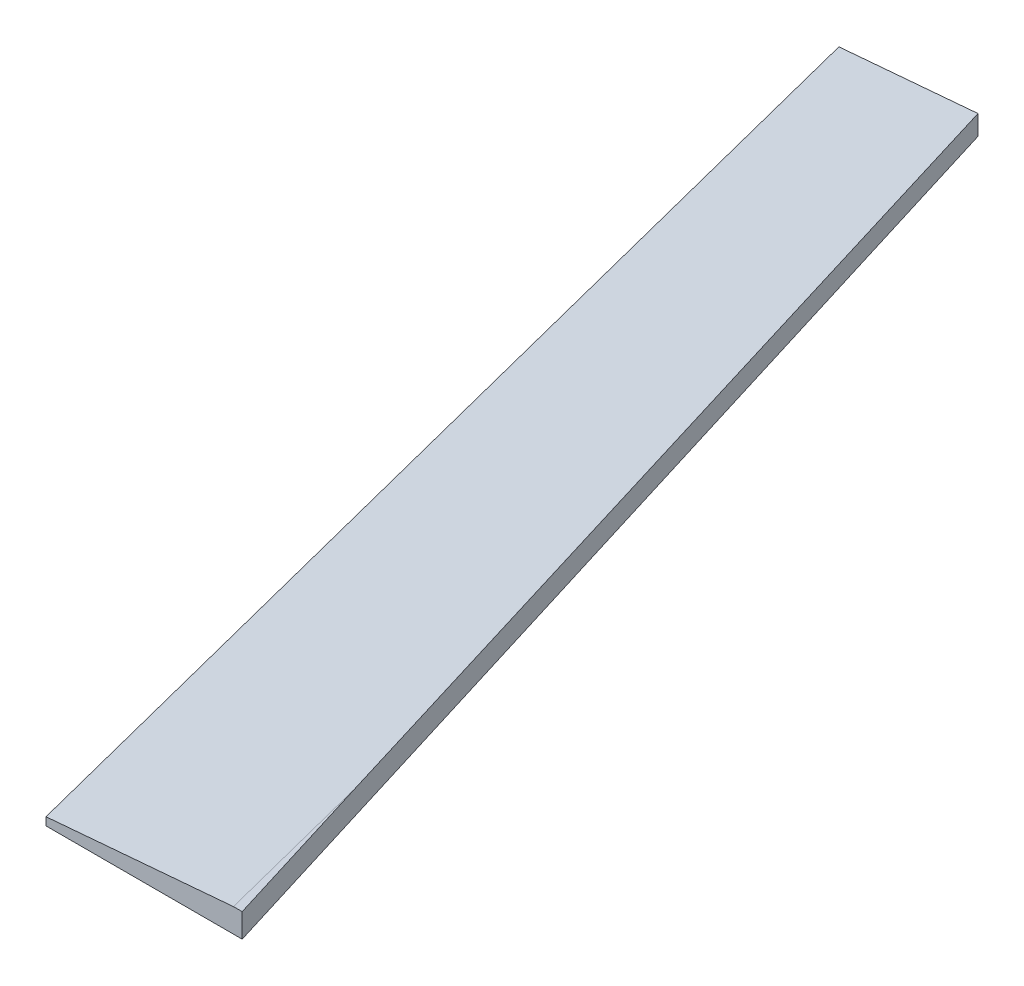
ISO-10303-21;
HEADER;
FILE_DESCRIPTION(('STEP AP214'),'2;1');
FILE_NAME('part.step','',(''),(''),'','','');
FILE_SCHEMA(('AUTOMOTIVE_DESIGN { 1 0 10303 214 1 1 1 1 }'));
ENDSEC;
DATA;
#1=APPLICATION_CONTEXT('core data for automotive mechanical design processes');
#2=APPLICATION_PROTOCOL_DEFINITION('international standard','automotive_design',2000,#1);
#3=PRODUCT_CONTEXT('',#1,'mechanical');
#4=PRODUCT('Part','Part','',(#3));
#5=PRODUCT_RELATED_PRODUCT_CATEGORY('part','',(#4));
#6=PRODUCT_DEFINITION_FORMATION('','',#4);
#7=PRODUCT_DEFINITION_CONTEXT('part definition',#1,'design');
#8=PRODUCT_DEFINITION('design','',#6,#7);
#9=PRODUCT_DEFINITION_SHAPE('','',#8);
#10=(LENGTH_UNIT() NAMED_UNIT(*) SI_UNIT(.MILLI.,.METRE.));
#11=(NAMED_UNIT(*) PLANE_ANGLE_UNIT() SI_UNIT($,.RADIAN.));
#12=(NAMED_UNIT(*) SI_UNIT($,.STERADIAN.) SOLID_ANGLE_UNIT());
#13=UNCERTAINTY_MEASURE_WITH_UNIT(LENGTH_MEASURE(1.E-05),#10,'distance_accuracy_value','');
#14=(GEOMETRIC_REPRESENTATION_CONTEXT(3) GLOBAL_UNCERTAINTY_ASSIGNED_CONTEXT((#13)) GLOBAL_UNIT_ASSIGNED_CONTEXT((#10,
#11,#12)) REPRESENTATION_CONTEXT('',''));
#15=CARTESIAN_POINT('',(0.,0.,0.));
#16=DIRECTION('',(0.,0.,1.));
#17=DIRECTION('',(1.,0.,0.));
#18=AXIS2_PLACEMENT_3D('',#15,#16,#17);
#19=CARTESIAN_POINT('',(126.581568969478,3.81,16.6787766494861));
#20=DIRECTION('',(0.,0.,1.));
#21=DIRECTION('',(1.,0.,0.));
#22=AXIS2_PLACEMENT_3D('',#19,#20,#21);
#23=PLANE('',#22);
#24=DIRECTION('',(0.,-1.,0.));
#25=VECTOR('',#24,1.);
#26=CARTESIAN_POINT('',(104.349973937028,3.81,16.6787766494861));
#27=LINE('',#26,#25);
#28=CARTESIAN_POINT('',(104.349973937028,1.2699999999998,16.6787766494861));
#29=VERTEX_POINT('',#28);
#30=CARTESIAN_POINT('',(104.349973937028,0.,16.6787766494861));
#31=VERTEX_POINT('',#30);
#32=EDGE_CURVE('E118',#29,#31,#27,.T.);
#33=ORIENTED_EDGE('',*,*,#32,.F.);
#34=DIRECTION('',(0.996424489399842,0.084488087469558,0.));
#35=VECTOR('',#34,1.);
#36=CARTESIAN_POINT('',(122.255576477698,2.78823859182976,16.6787766494861));
#37=LINE('',#36,#35);
#38=CARTESIAN_POINT('',(126.581568969478,3.15504494386778,16.6787766494861));
#39=VERTEX_POINT('',#38);
#40=EDGE_CURVE('E44',#29,#39,#37,.T.);
#41=ORIENTED_EDGE('',*,*,#40,.T.);
#42=DIRECTION('',(0.,-1.,0.));
#43=VECTOR('',#42,1.);
#44=CARTESIAN_POINT('',(126.581568969478,3.81,16.6787766494861));
#45=LINE('',#44,#43);
#46=CARTESIAN_POINT('',(126.581568969478,0.,16.6787766494861));
#47=VERTEX_POINT('',#46);
#48=EDGE_CURVE('E102',#39,#47,#45,.T.);
#49=ORIENTED_EDGE('',*,*,#48,.T.);
#50=DIRECTION('',(-1.,0.,0.));
#51=VECTOR('',#50,1.);
#52=CARTESIAN_POINT('',(126.581568969478,0.,16.6787766494861));
#53=LINE('',#52,#51);
#54=EDGE_CURVE('E109',#47,#31,#53,.T.);
#55=ORIENTED_EDGE('',*,*,#54,.T.);
#56=EDGE_LOOP('',(#33,#41,#49,#55));
#57=FACE_BOUND('',#56,.T.);
#58=ADVANCED_FACE('F35',(#57),#23,.F.);
#59=CARTESIAN_POINT('',(104.349973937028,3.81,16.6787766494861));
#60=DIRECTION('',(0.969168531093622,0.,-0.246398779091599));
#61=DIRECTION('',(-0.246398779091599,0.,-0.969168531093622));
#62=AXIS2_PLACEMENT_3D('',#59,#60,#61);
#63=PLANE('',#62);
#64=DIRECTION('',(0.,-1.,0.));
#65=VECTOR('',#64,1.);
#66=CARTESIAN_POINT('',(147.550785662563,3.81,186.601969436592));
#67=LINE('',#66,#65);
#68=CARTESIAN_POINT('',(147.550785662563,1.2699999999998,186.601969436592));
#69=VERTEX_POINT('',#68);
#70=CARTESIAN_POINT('',(147.550785662563,0.,186.601969436592));
#71=VERTEX_POINT('',#70);
#72=EDGE_CURVE('E101',#69,#71,#67,.T.);
#73=ORIENTED_EDGE('',*,*,#72,.F.);
#74=DIRECTION('',(-0.246398779091599,0.,-0.969168531093622));
#75=VECTOR('',#74,1.);
#76=CARTESIAN_POINT('',(104.349973937028,1.2699999999998,16.6787766494861));
#77=LINE('',#76,#75);
#78=EDGE_CURVE('E58',#69,#29,#77,.T.);
#79=ORIENTED_EDGE('',*,*,#78,.T.);
#80=ORIENTED_EDGE('',*,*,#32,.T.);
#81=DIRECTION('',(0.246398779091599,0.,0.969168531093622));
#82=VECTOR('',#81,1.);
#83=CARTESIAN_POINT('',(104.349973937028,0.,16.6787766494861));
#84=LINE('',#83,#82);
#85=EDGE_CURVE('E112',#31,#71,#84,.T.);
#86=ORIENTED_EDGE('',*,*,#85,.T.);
#87=EDGE_LOOP('',(#73,#79,#80,#86));
#88=FACE_BOUND('',#87,.T.);
#89=ADVANCED_FACE('F124',(#88),#63,.F.);
#90=CARTESIAN_POINT('',(178.902552059293,3.81,186.601969436592));
#91=DIRECTION('',(0.,0.,-1.));
#92=DIRECTION('',(-1.,0.,0.));
#93=AXIS2_PLACEMENT_3D('',#90,#91,#92);
#94=PLANE('',#93);
#95=DIRECTION('',(1.,0.,0.));
#96=VECTOR('',#95,1.);
#97=CARTESIAN_POINT('',(178.902552059293,3.81,186.601969436592));
#98=LINE('',#97,#96);
#99=CARTESIAN_POINT('',(177.506703459705,3.81,186.601969436592));
#100=VERTEX_POINT('',#99);
#101=CARTESIAN_POINT('',(178.902552059293,3.81,186.601969436592));
#102=VERTEX_POINT('',#101);
#103=EDGE_CURVE('E83',#100,#102,#98,.T.);
#104=ORIENTED_EDGE('',*,*,#103,.F.);
#105=DIRECTION('',(-0.996424489399842,-0.084488087469558,0.));
#106=VECTOR('',#105,1.);
#107=CARTESIAN_POINT('',(122.563954107116,-0.848664918919742,186.601969436592));
#108=LINE('',#107,#106);
#109=EDGE_CURVE('E121',#100,#69,#108,.T.);
#110=ORIENTED_EDGE('',*,*,#109,.T.);
#111=ORIENTED_EDGE('',*,*,#72,.T.);
#112=DIRECTION('',(1.,0.,0.));
#113=VECTOR('',#112,1.);
#114=CARTESIAN_POINT('',(178.902552059293,0.,186.601969436592));
#115=LINE('',#114,#113);
#116=CARTESIAN_POINT('',(178.902552059293,0.,186.601969436592));
#117=VERTEX_POINT('',#116);
#118=EDGE_CURVE('E97',#71,#117,#115,.T.);
#119=ORIENTED_EDGE('',*,*,#118,.T.);
#120=DIRECTION('',(0.,-1.,0.));
#121=VECTOR('',#120,1.);
#122=CARTESIAN_POINT('',(178.902552059293,3.81,186.601969436592));
#123=LINE('',#122,#121);
#124=EDGE_CURVE('E94',#102,#117,#123,.T.);
#125=ORIENTED_EDGE('',*,*,#124,.F.);
#126=EDGE_LOOP('',(#104,#110,#111,#119,#125));
#127=FACE_BOUND('',#126,.T.);
#128=ADVANCED_FACE('F95',(#127),#94,.F.);
#129=CARTESIAN_POINT('',(126.581568969478,3.81,16.6787766494861));
#130=DIRECTION('',(-0.955720616363866,0.,0.294275557015993));
#131=DIRECTION('',(0.294275557015993,0.,0.955720616363866));
#132=AXIS2_PLACEMENT_3D('',#129,#130,#131);
#133=PLANE('',#132);
#134=ORIENTED_EDGE('',*,*,#48,.F.);
#135=DIRECTION('',(0.294272773570041,0.00434938920309538,0.955711576548571));
#136=VECTOR('',#135,1.);
#137=CARTESIAN_POINT('',(112.774268706808,2.9509712813342,-28.1632810843227));
#138=LINE('',#137,#136);
#139=CARTESIAN_POINT('',(170.894789040605,3.81,160.595106054798));
#140=VERTEX_POINT('',#139);
#141=EDGE_CURVE('E11',#39,#140,#138,.T.);
#142=ORIENTED_EDGE('',*,*,#141,.T.);
#143=DIRECTION('',(-0.294275557015993,0.,-0.955720616363866));
#144=VECTOR('',#143,1.);
#145=CARTESIAN_POINT('',(126.581568969478,3.81,16.6787766494861));
#146=LINE('',#145,#144);
#147=EDGE_CURVE('E87',#102,#140,#146,.T.);
#148=ORIENTED_EDGE('',*,*,#147,.F.);
#149=ORIENTED_EDGE('',*,*,#124,.T.);
#150=DIRECTION('',(-0.294275557015993,0.,-0.955720616363866));
#151=VECTOR('',#150,1.);
#152=CARTESIAN_POINT('',(126.581568969478,0.,16.6787766494861));
#153=LINE('',#152,#151);
#154=EDGE_CURVE('E91',#117,#47,#153,.T.);
#155=ORIENTED_EDGE('',*,*,#154,.T.);
#156=EDGE_LOOP('',(#134,#142,#148,#149,#155));
#157=FACE_BOUND('',#156,.T.);
#158=ADVANCED_FACE('F104',(#157),#133,.F.);
#159=CARTESIAN_POINT('',(0.,3.81,0.));
#160=DIRECTION('',(0.,1.,0.));
#161=DIRECTION('',(0.,0.,1.));
#162=AXIS2_PLACEMENT_3D('',#159,#160,#161);
#163=PLANE('',#162);
#164=ORIENTED_EDGE('',*,*,#147,.T.);
#165=DIRECTION('',(0.246398779091599,0.,0.969168531093622));
#166=VECTOR('',#165,1.);
#167=CARTESIAN_POINT('',(175.688009044066,3.81,179.448438068413));
#168=LINE('',#167,#166);
#169=EDGE_CURVE('E89',#140,#100,#168,.T.);
#170=ORIENTED_EDGE('',*,*,#169,.T.);
#171=ORIENTED_EDGE('',*,*,#103,.T.);
#172=EDGE_LOOP('',(#164,#170,#171));
#173=FACE_BOUND('',#172,.T.);
#174=ADVANCED_FACE('F85',(#173),#163,.T.);
#175=CARTESIAN_POINT('',(0.,0.,0.));
#176=DIRECTION('',(0.,1.,0.));
#177=DIRECTION('',(0.,0.,1.));
#178=AXIS2_PLACEMENT_3D('',#175,#176,#177);
#179=PLANE('',#178);
#180=ORIENTED_EDGE('',*,*,#54,.F.);
#181=ORIENTED_EDGE('',*,*,#154,.F.);
#182=ORIENTED_EDGE('',*,*,#118,.F.);
#183=ORIENTED_EDGE('',*,*,#85,.F.);
#184=EDGE_LOOP('',(#180,#181,#182,#183));
#185=FACE_BOUND('',#184,.T.);
#186=ADVANCED_FACE('F127',(#185),#179,.F.);
#187=CARTESIAN_POINT('',(122.168940040974,3.81,-31.0599000104171));
#188=DIRECTION('',(-0.0844686031751185,0.996194698091746,0.0214750686038437));
#189=DIRECTION('',(-0.246398779091599,0.,-0.969168531093622));
#190=AXIS2_PLACEMENT_3D('',#187,#188,#189);
#191=PLANE('',#190);
#192=ORIENTED_EDGE('',*,*,#40,.F.);
#193=ORIENTED_EDGE('',*,*,#78,.F.);
#194=ORIENTED_EDGE('',*,*,#109,.F.);
#195=ORIENTED_EDGE('',*,*,#169,.F.);
#196=ORIENTED_EDGE('',*,*,#141,.F.);
#197=EDGE_LOOP('',(#192,#193,#194,#195,#196));
#198=FACE_BOUND('',#197,.T.);
#199=ADVANCED_FACE('F38',(#198),#191,.T.);
#200=CLOSED_SHELL('',(#58,#89,#128,#158,#174,#186,#199));
#201=MANIFOLD_SOLID_BREP('B2',#200);
#202=ADVANCED_BREP_SHAPE_REPRESENTATION('',(#18,#201),#14);
#203=SHAPE_DEFINITION_REPRESENTATION(#9,#202);
ENDSEC;
END-ISO-10303-21;
